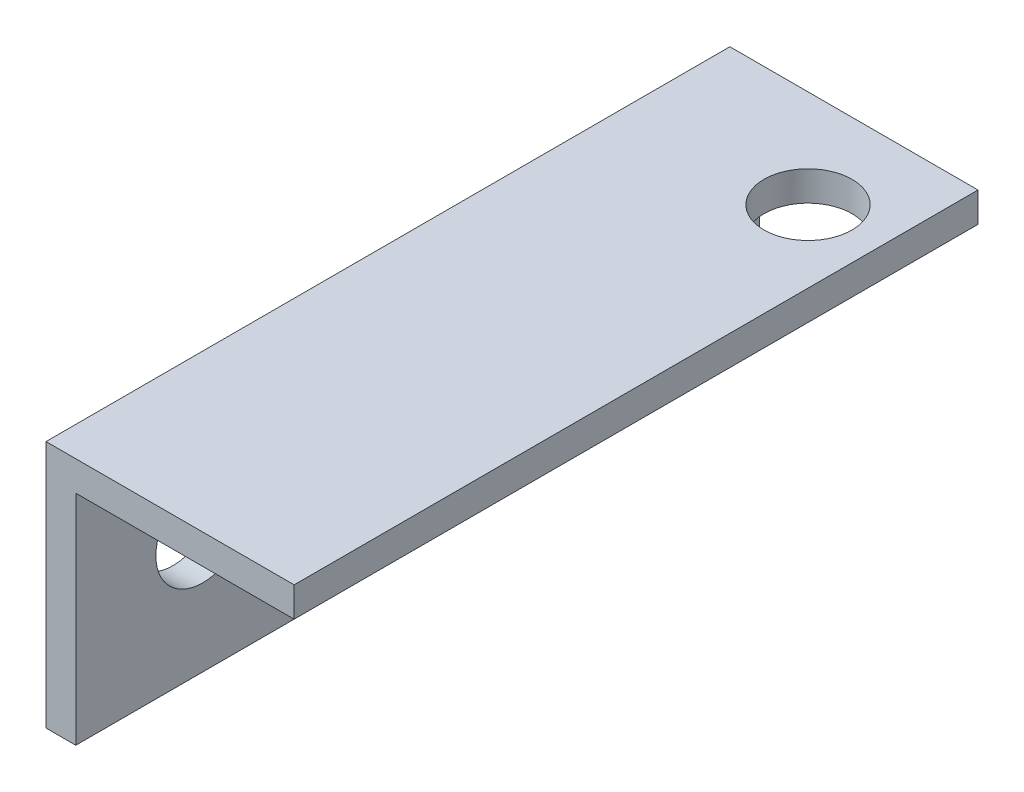
ISO-10303-21;
HEADER;
FILE_DESCRIPTION(('STEP AP214'),'2;1');
FILE_NAME('part.step','',(''),(''),'','','');
FILE_SCHEMA(('AUTOMOTIVE_DESIGN { 1 0 10303 214 1 1 1 1 }'));
ENDSEC;
DATA;
#1=APPLICATION_CONTEXT('core data for automotive mechanical design processes');
#2=APPLICATION_PROTOCOL_DEFINITION('international standard','automotive_design',2000,#1);
#3=PRODUCT_CONTEXT('',#1,'mechanical');
#4=PRODUCT('Part','Part','',(#3));
#5=PRODUCT_RELATED_PRODUCT_CATEGORY('part','',(#4));
#6=PRODUCT_DEFINITION_FORMATION('','',#4);
#7=PRODUCT_DEFINITION_CONTEXT('part definition',#1,'design');
#8=PRODUCT_DEFINITION('design','',#6,#7);
#9=PRODUCT_DEFINITION_SHAPE('','',#8);
#10=(LENGTH_UNIT() NAMED_UNIT(*) SI_UNIT(.MILLI.,.METRE.));
#11=(NAMED_UNIT(*) PLANE_ANGLE_UNIT() SI_UNIT($,.RADIAN.));
#12=(NAMED_UNIT(*) SI_UNIT($,.STERADIAN.) SOLID_ANGLE_UNIT());
#13=UNCERTAINTY_MEASURE_WITH_UNIT(LENGTH_MEASURE(1.E-05),#10,'distance_accuracy_value','');
#14=(GEOMETRIC_REPRESENTATION_CONTEXT(3) GLOBAL_UNCERTAINTY_ASSIGNED_CONTEXT((#13)) GLOBAL_UNIT_ASSIGNED_CONTEXT((#10,
#11,#12)) REPRESENTATION_CONTEXT('',''));
#15=CARTESIAN_POINT('',(0.,0.,0.));
#16=DIRECTION('',(0.,0.,1.));
#17=DIRECTION('',(1.,0.,0.));
#18=AXIS2_PLACEMENT_3D('',#15,#16,#17);
#19=CARTESIAN_POINT('',(0.,-12.7,35.));
#20=DIRECTION('',(1.,0.,0.));
#21=DIRECTION('',(0.,0.,-1.));
#22=AXIS2_PLACEMENT_3D('',#19,#20,#21);
#23=PLANE('',#22);
#24=CARTESIAN_POINT('',(0.,-6.35,15.));
#25=DIRECTION('',(-1.,0.,0.));
#26=DIRECTION('',(0.,0.,1.));
#27=AXIS2_PLACEMENT_3D('',#24,#25,#26);
#28=CIRCLE('',#27,2.4);
#29=CARTESIAN_POINT('',(0.,-6.35,17.4));
#30=VERTEX_POINT('',#29);
#31=EDGE_CURVE('E164',#30,#30,#28,.T.);
#32=ORIENTED_EDGE('',*,*,#31,.F.);
#33=EDGE_LOOP('',(#32));
#34=FACE_BOUND('',#33,.T.);
#35=CARTESIAN_POINT('',(0.,-6.35,28.5));
#36=DIRECTION('',(-1.,0.,0.));
#37=DIRECTION('',(0.,0.,1.));
#38=AXIS2_PLACEMENT_3D('',#35,#36,#37);
#39=CIRCLE('',#38,2.4);
#40=CARTESIAN_POINT('',(0.,-6.35,30.9));
#41=VERTEX_POINT('',#40);
#42=EDGE_CURVE('E167',#41,#41,#39,.T.);
#43=ORIENTED_EDGE('',*,*,#42,.F.);
#44=EDGE_LOOP('',(#43));
#45=FACE_BOUND('',#44,.T.);
#46=DIRECTION('',(0.,-1.,0.));
#47=VECTOR('',#46,1.);
#48=CARTESIAN_POINT('',(0.,-12.7,0.));
#49=LINE('',#48,#47);
#50=CARTESIAN_POINT('',(0.,0.,0.));
#51=VERTEX_POINT('',#50);
#52=CARTESIAN_POINT('',(0.,-12.7,0.));
#53=VERTEX_POINT('',#52);
#54=EDGE_CURVE('E118',#51,#53,#49,.T.);
#55=ORIENTED_EDGE('',*,*,#54,.T.);
#56=DIRECTION('',(0.,0.,-1.));
#57=VECTOR('',#56,1.);
#58=CARTESIAN_POINT('',(0.,-12.7,35.));
#59=LINE('',#58,#57);
#60=CARTESIAN_POINT('',(0.,-12.7,35.));
#61=VERTEX_POINT('',#60);
#62=EDGE_CURVE('E11',#61,#53,#59,.T.);
#63=ORIENTED_EDGE('',*,*,#62,.F.);
#64=DIRECTION('',(0.,-1.,0.));
#65=VECTOR('',#64,1.);
#66=CARTESIAN_POINT('',(0.,-12.7,35.));
#67=LINE('',#66,#65);
#68=CARTESIAN_POINT('',(0.,0.,35.));
#69=VERTEX_POINT('',#68);
#70=EDGE_CURVE('E129',#69,#61,#67,.T.);
#71=ORIENTED_EDGE('',*,*,#70,.F.);
#72=DIRECTION('',(0.,0.,-1.));
#73=VECTOR('',#72,1.);
#74=CARTESIAN_POINT('',(0.,0.,35.));
#75=LINE('',#74,#73);
#76=EDGE_CURVE('E114',#69,#51,#75,.T.);
#77=ORIENTED_EDGE('',*,*,#76,.T.);
#78=EDGE_LOOP('',(#55,#63,#71,#77));
#79=FACE_BOUND('',#78,.T.);
#80=ADVANCED_FACE('F33',(#34,#45,#79),#23,.F.);
#81=CARTESIAN_POINT('',(1.524,-12.7,35.));
#82=DIRECTION('',(0.,1.,0.));
#83=DIRECTION('',(0.,0.,1.));
#84=AXIS2_PLACEMENT_3D('',#81,#82,#83);
#85=PLANE('',#84);
#86=DIRECTION('',(1.,0.,0.));
#87=VECTOR('',#86,1.);
#88=CARTESIAN_POINT('',(1.524,-12.7,0.));
#89=LINE('',#88,#87);
#90=CARTESIAN_POINT('',(1.524,-12.7,0.));
#91=VERTEX_POINT('',#90);
#92=EDGE_CURVE('E121',#53,#91,#89,.T.);
#93=ORIENTED_EDGE('',*,*,#92,.T.);
#94=DIRECTION('',(0.,0.,-1.));
#95=VECTOR('',#94,1.);
#96=CARTESIAN_POINT('',(1.524,-12.7,35.));
#97=LINE('',#96,#95);
#98=CARTESIAN_POINT('',(1.524,-12.7,35.));
#99=VERTEX_POINT('',#98);
#100=EDGE_CURVE('E42',#99,#91,#97,.T.);
#101=ORIENTED_EDGE('',*,*,#100,.F.);
#102=DIRECTION('',(1.,0.,0.));
#103=VECTOR('',#102,1.);
#104=CARTESIAN_POINT('',(1.524,-12.7,35.));
#105=LINE('',#104,#103);
#106=EDGE_CURVE('E87',#61,#99,#105,.T.);
#107=ORIENTED_EDGE('',*,*,#106,.F.);
#108=ORIENTED_EDGE('',*,*,#62,.T.);
#109=EDGE_LOOP('',(#93,#101,#107,#108));
#110=FACE_BOUND('',#109,.T.);
#111=ADVANCED_FACE('F156',(#110),#85,.F.);
#112=CARTESIAN_POINT('',(1.524,-1.524,35.));
#113=DIRECTION('',(-1.,0.,0.));
#114=DIRECTION('',(0.,-1.,0.));
#115=AXIS2_PLACEMENT_3D('',#112,#113,#114);
#116=PLANE('',#115);
#117=CARTESIAN_POINT('',(1.524,-6.35,15.));
#118=DIRECTION('',(-1.,0.,0.));
#119=DIRECTION('',(0.,-1.,0.));
#120=AXIS2_PLACEMENT_3D('',#117,#118,#119);
#121=CIRCLE('',#120,2.4);
#122=CARTESIAN_POINT('',(1.524,-8.75,15.));
#123=VERTEX_POINT('',#122);
#124=EDGE_CURVE('E36',#123,#123,#121,.T.);
#125=ORIENTED_EDGE('',*,*,#124,.T.);
#126=EDGE_LOOP('',(#125));
#127=FACE_BOUND('',#126,.T.);
#128=CARTESIAN_POINT('',(1.524,-6.35,28.5));
#129=DIRECTION('',(-1.,0.,0.));
#130=DIRECTION('',(0.,-1.,0.));
#131=AXIS2_PLACEMENT_3D('',#128,#129,#130);
#132=CIRCLE('',#131,2.4);
#133=CARTESIAN_POINT('',(1.524,-8.75,28.5));
#134=VERTEX_POINT('',#133);
#135=EDGE_CURVE('E169',#134,#134,#132,.T.);
#136=ORIENTED_EDGE('',*,*,#135,.T.);
#137=EDGE_LOOP('',(#136));
#138=FACE_BOUND('',#137,.T.);
#139=DIRECTION('',(0.,1.,0.));
#140=VECTOR('',#139,1.);
#141=CARTESIAN_POINT('',(1.524,-1.524,0.));
#142=LINE('',#141,#140);
#143=CARTESIAN_POINT('',(1.524,-1.524,0.));
#144=VERTEX_POINT('',#143);
#145=EDGE_CURVE('E124',#91,#144,#142,.T.);
#146=ORIENTED_EDGE('',*,*,#145,.T.);
#147=DIRECTION('',(0.,0.,-1.));
#148=VECTOR('',#147,1.);
#149=CARTESIAN_POINT('',(1.524,-1.524,35.));
#150=LINE('',#149,#148);
#151=CARTESIAN_POINT('',(1.524,-1.524,35.));
#152=VERTEX_POINT('',#151);
#153=EDGE_CURVE('E109',#152,#144,#150,.T.);
#154=ORIENTED_EDGE('',*,*,#153,.F.);
#155=DIRECTION('',(0.,1.,0.));
#156=VECTOR('',#155,1.);
#157=CARTESIAN_POINT('',(1.524,-1.524,35.));
#158=LINE('',#157,#156);
#159=EDGE_CURVE('E100',#99,#152,#158,.T.);
#160=ORIENTED_EDGE('',*,*,#159,.F.);
#161=ORIENTED_EDGE('',*,*,#100,.T.);
#162=EDGE_LOOP('',(#146,#154,#160,#161));
#163=FACE_BOUND('',#162,.T.);
#164=ADVANCED_FACE('F136',(#127,#138,#163),#116,.F.);
#165=CARTESIAN_POINT('',(12.7,-1.524,35.));
#166=DIRECTION('',(0.,1.,0.));
#167=DIRECTION('',(-1.,0.,0.));
#168=AXIS2_PLACEMENT_3D('',#165,#166,#167);
#169=PLANE('',#168);
#170=CARTESIAN_POINT('',(9.,-1.524,5.00000000000002));
#171=DIRECTION('',(0.,1.,0.));
#172=DIRECTION('',(-1.,0.,0.));
#173=AXIS2_PLACEMENT_3D('',#170,#171,#172);
#174=CIRCLE('',#173,2.24999999999997);
#175=CARTESIAN_POINT('',(6.75000000000003,-1.524,5.00000000000002));
#176=VERTEX_POINT('',#175);
#177=EDGE_CURVE('E122',#176,#176,#174,.T.);
#178=ORIENTED_EDGE('',*,*,#177,.T.);
#179=EDGE_LOOP('',(#178));
#180=FACE_BOUND('',#179,.T.);
#181=DIRECTION('',(1.,0.,0.));
#182=VECTOR('',#181,1.);
#183=CARTESIAN_POINT('',(12.7,-1.524,0.));
#184=LINE('',#183,#182);
#185=CARTESIAN_POINT('',(12.7,-1.524,0.));
#186=VERTEX_POINT('',#185);
#187=EDGE_CURVE('E108',#144,#186,#184,.T.);
#188=ORIENTED_EDGE('',*,*,#187,.T.);
#189=DIRECTION('',(0.,0.,-1.));
#190=VECTOR('',#189,1.);
#191=CARTESIAN_POINT('',(12.7,-1.524,35.));
#192=LINE('',#191,#190);
#193=CARTESIAN_POINT('',(12.7,-1.524,35.));
#194=VERTEX_POINT('',#193);
#195=EDGE_CURVE('E105',#194,#186,#192,.T.);
#196=ORIENTED_EDGE('',*,*,#195,.F.);
#197=DIRECTION('',(1.,0.,0.));
#198=VECTOR('',#197,1.);
#199=CARTESIAN_POINT('',(12.7,-1.524,35.));
#200=LINE('',#199,#198);
#201=EDGE_CURVE('E94',#152,#194,#200,.T.);
#202=ORIENTED_EDGE('',*,*,#201,.F.);
#203=ORIENTED_EDGE('',*,*,#153,.T.);
#204=EDGE_LOOP('',(#188,#196,#202,#203));
#205=FACE_BOUND('',#204,.T.);
#206=ADVANCED_FACE('F106',(#180,#205),#169,.F.);
#207=CARTESIAN_POINT('',(12.7,0.,35.));
#208=DIRECTION('',(-1.,0.,0.));
#209=DIRECTION('',(0.,0.,1.));
#210=AXIS2_PLACEMENT_3D('',#207,#208,#209);
#211=PLANE('',#210);
#212=DIRECTION('',(0.,1.,0.));
#213=VECTOR('',#212,1.);
#214=CARTESIAN_POINT('',(12.7,0.,0.));
#215=LINE('',#214,#213);
#216=CARTESIAN_POINT('',(12.7,0.,0.));
#217=VERTEX_POINT('',#216);
#218=EDGE_CURVE('E73',#186,#217,#215,.T.);
#219=ORIENTED_EDGE('',*,*,#218,.T.);
#220=DIRECTION('',(0.,0.,-1.));
#221=VECTOR('',#220,1.);
#222=CARTESIAN_POINT('',(12.7,0.,35.));
#223=LINE('',#222,#221);
#224=CARTESIAN_POINT('',(12.7,0.,35.));
#225=VERTEX_POINT('',#224);
#226=EDGE_CURVE('E110',#225,#217,#223,.T.);
#227=ORIENTED_EDGE('',*,*,#226,.F.);
#228=DIRECTION('',(0.,1.,0.));
#229=VECTOR('',#228,1.);
#230=CARTESIAN_POINT('',(12.7,0.,35.));
#231=LINE('',#230,#229);
#232=EDGE_CURVE('E98',#194,#225,#231,.T.);
#233=ORIENTED_EDGE('',*,*,#232,.F.);
#234=ORIENTED_EDGE('',*,*,#195,.T.);
#235=EDGE_LOOP('',(#219,#227,#233,#234));
#236=FACE_BOUND('',#235,.T.);
#237=ADVANCED_FACE('F112',(#236),#211,.F.);
#238=CARTESIAN_POINT('',(0.,0.,35.));
#239=DIRECTION('',(0.,-1.,0.));
#240=DIRECTION('',(0.,0.,-1.));
#241=AXIS2_PLACEMENT_3D('',#238,#239,#240);
#242=PLANE('',#241);
#243=CARTESIAN_POINT('',(9.,0.,5.00000000000002));
#244=DIRECTION('',(0.,1.,0.));
#245=DIRECTION('',(0.,0.,1.));
#246=AXIS2_PLACEMENT_3D('',#243,#244,#245);
#247=CIRCLE('',#246,2.24999999999999);
#248=CARTESIAN_POINT('',(9.,0.,7.25000000000001));
#249=VERTEX_POINT('',#248);
#250=EDGE_CURVE('E172',#249,#249,#247,.T.);
#251=ORIENTED_EDGE('',*,*,#250,.F.);
#252=EDGE_LOOP('',(#251));
#253=FACE_BOUND('',#252,.T.);
#254=DIRECTION('',(-1.,0.,0.));
#255=VECTOR('',#254,1.);
#256=CARTESIAN_POINT('',(0.,0.,0.));
#257=LINE('',#256,#255);
#258=EDGE_CURVE('E79',#217,#51,#257,.T.);
#259=ORIENTED_EDGE('',*,*,#258,.T.);
#260=ORIENTED_EDGE('',*,*,#76,.F.);
#261=DIRECTION('',(-1.,0.,0.));
#262=VECTOR('',#261,1.);
#263=CARTESIAN_POINT('',(0.,0.,35.));
#264=LINE('',#263,#262);
#265=EDGE_CURVE('E50',#225,#69,#264,.T.);
#266=ORIENTED_EDGE('',*,*,#265,.F.);
#267=ORIENTED_EDGE('',*,*,#226,.T.);
#268=EDGE_LOOP('',(#259,#260,#266,#267));
#269=FACE_BOUND('',#268,.T.);
#270=ADVANCED_FACE('F143',(#253,#269),#242,.F.);
#271=CARTESIAN_POINT('',(0.,0.,35.));
#272=DIRECTION('',(0.,0.,-1.));
#273=DIRECTION('',(-1.,0.,0.));
#274=AXIS2_PLACEMENT_3D('',#271,#272,#273);
#275=PLANE('',#274);
#276=ORIENTED_EDGE('',*,*,#70,.T.);
#277=ORIENTED_EDGE('',*,*,#106,.T.);
#278=ORIENTED_EDGE('',*,*,#159,.T.);
#279=ORIENTED_EDGE('',*,*,#201,.T.);
#280=ORIENTED_EDGE('',*,*,#232,.T.);
#281=ORIENTED_EDGE('',*,*,#265,.T.);
#282=EDGE_LOOP('',(#276,#277,#278,#279,#280,#281));
#283=FACE_BOUND('',#282,.T.);
#284=ADVANCED_FACE('F96',(#283),#275,.F.);
#285=CARTESIAN_POINT('',(0.,0.,0.));
#286=DIRECTION('',(0.,0.,-1.));
#287=DIRECTION('',(-1.,0.,0.));
#288=AXIS2_PLACEMENT_3D('',#285,#286,#287);
#289=PLANE('',#288);
#290=ORIENTED_EDGE('',*,*,#54,.F.);
#291=ORIENTED_EDGE('',*,*,#258,.F.);
#292=ORIENTED_EDGE('',*,*,#218,.F.);
#293=ORIENTED_EDGE('',*,*,#187,.F.);
#294=ORIENTED_EDGE('',*,*,#145,.F.);
#295=ORIENTED_EDGE('',*,*,#92,.F.);
#296=EDGE_LOOP('',(#290,#291,#292,#293,#294,#295));
#297=FACE_BOUND('',#296,.T.);
#298=ADVANCED_FACE('F139',(#297),#289,.T.);
#299=CARTESIAN_POINT('',(9.,0.,5.00000000000002));
#300=DIRECTION('',(0.,1.,0.));
#301=DIRECTION('',(0.,0.,1.));
#302=AXIS2_PLACEMENT_3D('',#299,#300,#301);
#303=CYLINDRICAL_SURFACE('',#302,2.24999999999997);
#304=ORIENTED_EDGE('',*,*,#250,.T.);
#305=EDGE_LOOP('',(#304));
#306=FACE_BOUND('',#305,.T.);
#307=ORIENTED_EDGE('',*,*,#177,.F.);
#308=EDGE_LOOP('',(#307));
#309=FACE_BOUND('',#308,.T.);
#310=ADVANCED_FACE('F185',(#306,#309),#303,.F.);
#311=CARTESIAN_POINT('',(0.,-6.35,28.5));
#312=DIRECTION('',(-1.,0.,0.));
#313=DIRECTION('',(0.,0.,1.));
#314=AXIS2_PLACEMENT_3D('',#311,#312,#313);
#315=CYLINDRICAL_SURFACE('',#314,2.4);
#316=ORIENTED_EDGE('',*,*,#42,.T.);
#317=EDGE_LOOP('',(#316));
#318=FACE_BOUND('',#317,.T.);
#319=ORIENTED_EDGE('',*,*,#135,.F.);
#320=EDGE_LOOP('',(#319));
#321=FACE_BOUND('',#320,.T.);
#322=ADVANCED_FACE('F187',(#318,#321),#315,.F.);
#323=CARTESIAN_POINT('',(0.,-6.35,15.));
#324=DIRECTION('',(-1.,0.,0.));
#325=DIRECTION('',(0.,0.,1.));
#326=AXIS2_PLACEMENT_3D('',#323,#324,#325);
#327=CYLINDRICAL_SURFACE('',#326,2.4);
#328=ORIENTED_EDGE('',*,*,#31,.T.);
#329=EDGE_LOOP('',(#328));
#330=FACE_BOUND('',#329,.T.);
#331=ORIENTED_EDGE('',*,*,#124,.F.);
#332=EDGE_LOOP('',(#331));
#333=FACE_BOUND('',#332,.T.);
#334=ADVANCED_FACE('F194',(#330,#333),#327,.F.);
#335=CLOSED_SHELL('',(#80,#111,#164,#206,#237,#270,#284,#298,#310,#322,#334));
#336=MANIFOLD_SOLID_BREP('B2',#335);
#337=ADVANCED_BREP_SHAPE_REPRESENTATION('',(#18,#336),#14);
#338=SHAPE_DEFINITION_REPRESENTATION(#9,#337);
ENDSEC;
END-ISO-10303-21;
